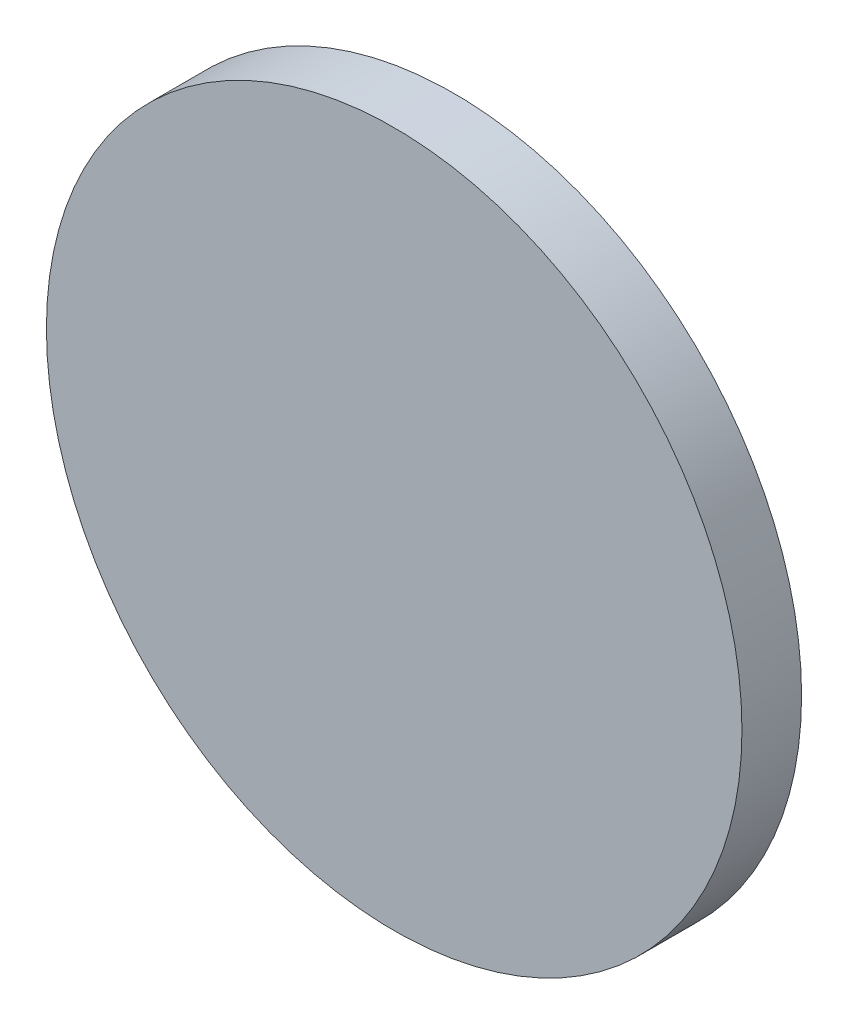
ISO-10303-21;
HEADER;
FILE_DESCRIPTION(('STEP AP214'),'2;1');
FILE_NAME('part.step','',(''),(''),'','','');
FILE_SCHEMA(('AUTOMOTIVE_DESIGN { 1 0 10303 214 1 1 1 1 }'));
ENDSEC;
DATA;
#1=APPLICATION_CONTEXT('core data for automotive mechanical design processes');
#2=APPLICATION_PROTOCOL_DEFINITION('international standard','automotive_design',2000,#1);
#3=PRODUCT_CONTEXT('',#1,'mechanical');
#4=PRODUCT('Part','Part','',(#3));
#5=PRODUCT_RELATED_PRODUCT_CATEGORY('part','',(#4));
#6=PRODUCT_DEFINITION_FORMATION('','',#4);
#7=PRODUCT_DEFINITION_CONTEXT('part definition',#1,'design');
#8=PRODUCT_DEFINITION('design','',#6,#7);
#9=PRODUCT_DEFINITION_SHAPE('','',#8);
#10=(LENGTH_UNIT() NAMED_UNIT(*) SI_UNIT(.MILLI.,.METRE.));
#11=(NAMED_UNIT(*) PLANE_ANGLE_UNIT() SI_UNIT($,.RADIAN.));
#12=(NAMED_UNIT(*) SI_UNIT($,.STERADIAN.) SOLID_ANGLE_UNIT());
#13=UNCERTAINTY_MEASURE_WITH_UNIT(LENGTH_MEASURE(1.E-05),#10,'distance_accuracy_value','');
#14=(GEOMETRIC_REPRESENTATION_CONTEXT(3) GLOBAL_UNCERTAINTY_ASSIGNED_CONTEXT((#13)) GLOBAL_UNIT_ASSIGNED_CONTEXT((#10,
#11,#12)) REPRESENTATION_CONTEXT('',''));
#15=CARTESIAN_POINT('',(0.,0.,0.));
#16=DIRECTION('',(0.,0.,1.));
#17=DIRECTION('',(1.,0.,0.));
#18=AXIS2_PLACEMENT_3D('',#15,#16,#17);
#19=CARTESIAN_POINT('',(1.6002,2.504440006176,0.76487));
#20=DIRECTION('',(0.,0.,-1.));
#21=DIRECTION('',(-1.,0.,0.));
#22=AXIS2_PLACEMENT_3D('',#19,#20,#21);
#23=PLANE('',#22);
#24=CARTESIAN_POINT('',(1.6002,2.504440006176,0.76487));
#25=DIRECTION('',(0.,0.,1.));
#26=DIRECTION('',(1.,0.,0.));
#27=AXIS2_PLACEMENT_3D('',#24,#25,#26);
#28=CIRCLE('',#27,0.200024667);
#29=CARTESIAN_POINT('',(1.800224667,2.504440006176,0.76487));
#30=VERTEX_POINT('',#29);
#31=EDGE_CURVE('E18',#30,#30,#28,.T.);
#32=ORIENTED_EDGE('',*,*,#31,.F.);
#33=EDGE_LOOP('',(#32));
#34=FACE_BOUND('',#33,.T.);
#35=ADVANCED_FACE('F15',(#34),#23,.T.);
#36=CARTESIAN_POINT('',(1.6002,2.504440006176,0.76487));
#37=DIRECTION('',(0.,0.,1.));
#38=DIRECTION('',(1.,0.,0.));
#39=AXIS2_PLACEMENT_3D('',#36,#37,#38);
#40=CYLINDRICAL_SURFACE('',#39,0.200024667);
#41=CARTESIAN_POINT('',(1.6002,2.504440006176,0.79916));
#42=DIRECTION('',(0.,0.,1.));
#43=DIRECTION('',(1.,0.,0.));
#44=AXIS2_PLACEMENT_3D('',#41,#42,#43);
#45=CIRCLE('',#44,0.200024667);
#46=CARTESIAN_POINT('',(1.800224667,2.504440006176,0.79916));
#47=VERTEX_POINT('',#46);
#48=EDGE_CURVE('E10',#47,#47,#45,.T.);
#49=ORIENTED_EDGE('',*,*,#48,.F.);
#50=EDGE_LOOP('',(#49));
#51=FACE_BOUND('',#50,.T.);
#52=ORIENTED_EDGE('',*,*,#31,.T.);
#53=EDGE_LOOP('',(#52));
#54=FACE_BOUND('',#53,.T.);
#55=ADVANCED_FACE('F27',(#51,#54),#40,.T.);
#56=CARTESIAN_POINT('',(1.6002,2.504440006176,0.79916));
#57=DIRECTION('',(0.,0.,1.));
#58=DIRECTION('',(1.,0.,0.));
#59=AXIS2_PLACEMENT_3D('',#56,#57,#58);
#60=PLANE('',#59);
#61=ORIENTED_EDGE('',*,*,#48,.T.);
#62=EDGE_LOOP('',(#61));
#63=FACE_BOUND('',#62,.T.);
#64=ADVANCED_FACE('F34',(#63),#60,.T.);
#65=CLOSED_SHELL('',(#35,#55,#64));
#66=MANIFOLD_SOLID_BREP('B1',#65);
#67=ADVANCED_BREP_SHAPE_REPRESENTATION('',(#18,#66),#14);
#68=SHAPE_DEFINITION_REPRESENTATION(#9,#67);
ENDSEC;
END-ISO-10303-21;
